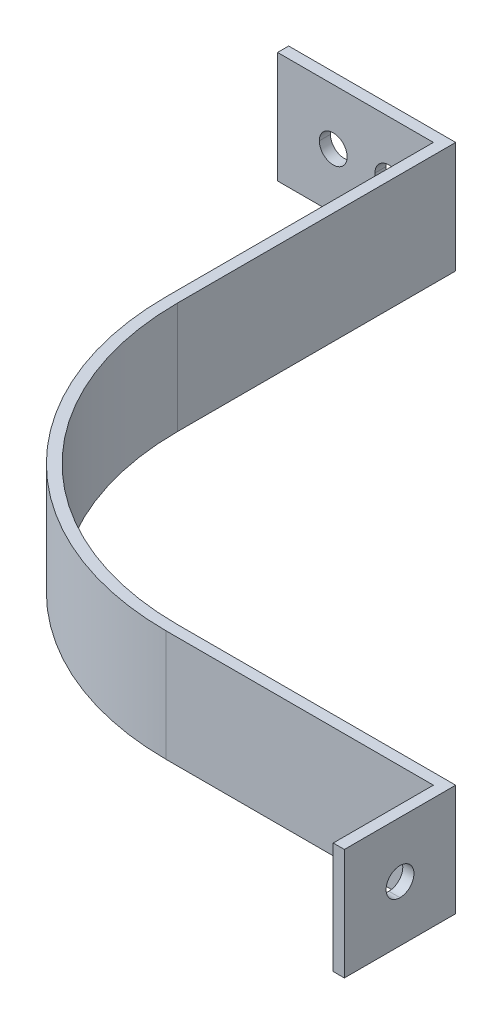
ISO-10303-21;
HEADER;
FILE_DESCRIPTION(('STEP AP214'),'2;1');
FILE_NAME('part.step','',(''),(''),'','','');
FILE_SCHEMA(('AUTOMOTIVE_DESIGN { 1 0 10303 214 1 1 1 1 }'));
ENDSEC;
DATA;
#1=APPLICATION_CONTEXT('core data for automotive mechanical design processes');
#2=APPLICATION_PROTOCOL_DEFINITION('international standard','automotive_design',2000,#1);
#3=PRODUCT_CONTEXT('',#1,'mechanical');
#4=PRODUCT('Part','Part','',(#3));
#5=PRODUCT_RELATED_PRODUCT_CATEGORY('part','',(#4));
#6=PRODUCT_DEFINITION_FORMATION('','',#4);
#7=PRODUCT_DEFINITION_CONTEXT('part definition',#1,'design');
#8=PRODUCT_DEFINITION('design','',#6,#7);
#9=PRODUCT_DEFINITION_SHAPE('','',#8);
#10=(LENGTH_UNIT() NAMED_UNIT(*) SI_UNIT(.MILLI.,.METRE.));
#11=(NAMED_UNIT(*) PLANE_ANGLE_UNIT() SI_UNIT($,.RADIAN.));
#12=(NAMED_UNIT(*) SI_UNIT($,.STERADIAN.) SOLID_ANGLE_UNIT());
#13=UNCERTAINTY_MEASURE_WITH_UNIT(LENGTH_MEASURE(1.E-05),#10,'distance_accuracy_value','');
#14=(GEOMETRIC_REPRESENTATION_CONTEXT(3) GLOBAL_UNCERTAINTY_ASSIGNED_CONTEXT((#13)) GLOBAL_UNIT_ASSIGNED_CONTEXT((#10,
#11,#12)) REPRESENTATION_CONTEXT('',''));
#15=CARTESIAN_POINT('',(0.,0.,0.));
#16=DIRECTION('',(0.,0.,1.));
#17=DIRECTION('',(1.,0.,0.));
#18=AXIS2_PLACEMENT_3D('',#15,#16,#17);
#19=CARTESIAN_POINT('',(27.4712813737907,0.,119.155051635885));
#20=DIRECTION('',(1.,0.,0.));
#21=DIRECTION('',(0.,0.,-1.));
#22=AXIS2_PLACEMENT_3D('',#19,#20,#21);
#23=PLANE('',#22);
#24=DIRECTION('',(0.,0.,-1.));
#25=VECTOR('',#24,1.);
#26=CARTESIAN_POINT('',(27.4712813737907,7.69230769133077,118.385820866752));
#27=LINE('',#26,#25);
#28=CARTESIAN_POINT('',(27.4712813737907,7.69230769133077,119.155051635885));
#29=VERTEX_POINT('',#28);
#30=CARTESIAN_POINT('',(27.4712813737907,7.69230769133077,117.616590097619));
#31=VERTEX_POINT('',#30);
#32=EDGE_CURVE('E11',#29,#31,#27,.T.);
#33=ORIENTED_EDGE('',*,*,#32,.T.);
#34=DIRECTION('',(0.,1.,0.));
#35=VECTOR('',#34,1.);
#36=CARTESIAN_POINT('',(27.4712813737907,0.,117.616590097619));
#37=LINE('',#36,#35);
#38=CARTESIAN_POINT('',(27.4712813737907,-7.69230769133077,117.616590097619));
#39=VERTEX_POINT('',#38);
#40=EDGE_CURVE('E73',#39,#31,#37,.T.);
#41=ORIENTED_EDGE('',*,*,#40,.F.);
#42=DIRECTION('',(0.,0.,-1.));
#43=VECTOR('',#42,1.);
#44=CARTESIAN_POINT('',(27.4712813737907,-7.69230769133077,118.385820866752));
#45=LINE('',#44,#43);
#46=CARTESIAN_POINT('',(27.4712813737907,-7.69230769133077,119.155051635885));
#47=VERTEX_POINT('',#46);
#48=EDGE_CURVE('E52',#47,#39,#45,.T.);
#49=ORIENTED_EDGE('',*,*,#48,.F.);
#50=DIRECTION('',(0.,1.,0.));
#51=VECTOR('',#50,1.);
#52=CARTESIAN_POINT('',(27.4712813737907,0.,119.155051635885));
#53=LINE('',#52,#51);
#54=EDGE_CURVE('E59',#47,#29,#53,.T.);
#55=ORIENTED_EDGE('',*,*,#54,.T.);
#56=EDGE_LOOP('',(#33,#41,#49,#55));
#57=FACE_BOUND('',#56,.T.);
#58=ADVANCED_FACE('F48',(#57),#23,.F.);
#59=CARTESIAN_POINT('',(49.0097429095169,0.,156.078128554273));
#60=DIRECTION('',(1.,0.,0.));
#61=DIRECTION('',(0.,0.,-1.));
#62=AXIS2_PLACEMENT_3D('',#59,#60,#61);
#63=PLANE('',#62);
#64=DIRECTION('',(0.,0.,-1.));
#65=VECTOR('',#64,1.);
#66=CARTESIAN_POINT('',(49.0097429095169,7.69230769133077,137.616590095079));
#67=LINE('',#66,#65);
#68=CARTESIAN_POINT('',(49.0097429095169,7.69230769133077,156.078128554273));
#69=VERTEX_POINT('',#68);
#70=CARTESIAN_POINT('',(49.0097429095169,7.69230769133077,119.155051635885));
#71=VERTEX_POINT('',#70);
#72=EDGE_CURVE('E302',#69,#71,#67,.T.);
#73=ORIENTED_EDGE('',*,*,#72,.T.);
#74=DIRECTION('',(0.,1.,0.));
#75=VECTOR('',#74,1.);
#76=CARTESIAN_POINT('',(49.0097429095169,0.,119.155051635885));
#77=LINE('',#76,#75);
#78=CARTESIAN_POINT('',(49.0097429095169,-7.69230769133077,119.155051635885));
#79=VERTEX_POINT('',#78);
#80=EDGE_CURVE('E282',#79,#71,#77,.T.);
#81=ORIENTED_EDGE('',*,*,#80,.F.);
#82=DIRECTION('',(0.,0.,-1.));
#83=VECTOR('',#82,1.);
#84=CARTESIAN_POINT('',(49.0097429095169,-7.69230769133077,137.616590095079));
#85=LINE('',#84,#83);
#86=CARTESIAN_POINT('',(49.0097429095169,-7.69230769133077,156.078128554273));
#87=VERTEX_POINT('',#86);
#88=EDGE_CURVE('E269',#87,#79,#85,.T.);
#89=ORIENTED_EDGE('',*,*,#88,.F.);
#90=DIRECTION('',(0.,1.,0.));
#91=VECTOR('',#90,1.);
#92=CARTESIAN_POINT('',(49.0097429095169,0.,156.078128554273));
#93=LINE('',#92,#91);
#94=EDGE_CURVE('E306',#87,#69,#93,.T.);
#95=ORIENTED_EDGE('',*,*,#94,.T.);
#96=EDGE_LOOP('',(#73,#81,#89,#95));
#97=FACE_BOUND('',#96,.T.);
#98=ADVANCED_FACE('F882',(#97),#63,.F.);
#99=CARTESIAN_POINT('',(89.0097429044369,0.,156.078128554273));
#100=DIRECTION('',(0.,-1.,0.));
#101=DIRECTION('',(-1.,0.,0.));
#102=AXIS2_PLACEMENT_3D('',#99,#100,#101);
#103=CYLINDRICAL_SURFACE('',#102,39.99999999492);
#104=CARTESIAN_POINT('',(89.0097429044369,7.69230769133077,156.078128554273));
#105=DIRECTION('',(0.,-1.,0.));
#106=DIRECTION('',(-1.,0.,0.));
#107=AXIS2_PLACEMENT_3D('',#104,#105,#106);
#108=CIRCLE('',#107,39.99999999492);
#109=CARTESIAN_POINT('',(89.0097429044369,7.69230769133077,196.078128549193));
#110=VERTEX_POINT('',#109);
#111=EDGE_CURVE('E310',#110,#69,#108,.T.);
#112=ORIENTED_EDGE('',*,*,#111,.T.);
#113=ORIENTED_EDGE('',*,*,#94,.F.);
#114=CARTESIAN_POINT('',(89.0097429044369,-7.69230769133077,156.078128554273));
#115=DIRECTION('',(0.,-1.,0.));
#116=DIRECTION('',(-1.,0.,0.));
#117=AXIS2_PLACEMENT_3D('',#114,#115,#116);
#118=CIRCLE('',#117,39.99999999492);
#119=CARTESIAN_POINT('',(89.0097429044369,-7.69230769133077,196.078128549193));
#120=VERTEX_POINT('',#119);
#121=EDGE_CURVE('E273',#120,#87,#118,.T.);
#122=ORIENTED_EDGE('',*,*,#121,.F.);
#123=DIRECTION('',(0.,1.,0.));
#124=VECTOR('',#123,1.);
#125=CARTESIAN_POINT('',(89.0097429044369,0.,196.078128549193));
#126=LINE('',#125,#124);
#127=EDGE_CURVE('E261',#120,#110,#126,.T.);
#128=ORIENTED_EDGE('',*,*,#127,.T.);
#129=EDGE_LOOP('',(#112,#113,#122,#128));
#130=FACE_BOUND('',#129,.T.);
#131=ADVANCED_FACE('F896',(#130),#103,.T.);
#132=CARTESIAN_POINT('',(125.932819822824,0.,196.078128549193));
#133=DIRECTION('',(0.,0.,-1.));
#134=DIRECTION('',(-1.,0.,0.));
#135=AXIS2_PLACEMENT_3D('',#132,#133,#134);
#136=PLANE('',#135);
#137=DIRECTION('',(-1.,0.,0.));
#138=VECTOR('',#137,1.);
#139=CARTESIAN_POINT('',(107.471281363631,7.69230769133077,196.078128549193));
#140=LINE('',#139,#138);
#141=CARTESIAN_POINT('',(125.932819822824,7.69230769133077,196.078128549193));
#142=VERTEX_POINT('',#141);
#143=EDGE_CURVE('E317',#142,#110,#140,.T.);
#144=ORIENTED_EDGE('',*,*,#143,.T.);
#145=ORIENTED_EDGE('',*,*,#127,.F.);
#146=DIRECTION('',(-1.,0.,0.));
#147=VECTOR('',#146,1.);
#148=CARTESIAN_POINT('',(107.471281363631,-7.69230769133077,196.078128549193));
#149=LINE('',#148,#147);
#150=CARTESIAN_POINT('',(125.932819822824,-7.69230769133077,196.078128549193));
#151=VERTEX_POINT('',#150);
#152=EDGE_CURVE('E324',#151,#120,#149,.T.);
#153=ORIENTED_EDGE('',*,*,#152,.F.);
#154=DIRECTION('',(0.,1.,0.));
#155=VECTOR('',#154,1.);
#156=CARTESIAN_POINT('',(125.932819822824,0.,196.078128549193));
#157=LINE('',#156,#155);
#158=EDGE_CURVE('E314',#151,#142,#157,.T.);
#159=ORIENTED_EDGE('',*,*,#158,.T.);
#160=EDGE_LOOP('',(#144,#145,#153,#159));
#161=FACE_BOUND('',#160,.T.);
#162=ADVANCED_FACE('F773',(#161),#136,.F.);
#163=CARTESIAN_POINT('',(127.471281361091,0.,209.924282393588));
#164=DIRECTION('',(0.,0.,-1.));
#165=DIRECTION('',(-1.,0.,0.));
#166=AXIS2_PLACEMENT_3D('',#163,#164,#165);
#167=PLANE('',#166);
#168=DIRECTION('',(-1.,0.,0.));
#169=VECTOR('',#168,1.);
#170=CARTESIAN_POINT('',(126.702050591958,7.69230769133077,209.924282393588));
#171=LINE('',#170,#169);
#172=CARTESIAN_POINT('',(127.471281361091,7.69230769133077,209.924282393588));
#173=VERTEX_POINT('',#172);
#174=CARTESIAN_POINT('',(125.932819822824,7.69230769133077,209.924282393588));
#175=VERTEX_POINT('',#174);
#176=EDGE_CURVE('E318',#173,#175,#171,.T.);
#177=ORIENTED_EDGE('',*,*,#176,.T.);
#178=DIRECTION('',(0.,1.,0.));
#179=VECTOR('',#178,1.);
#180=CARTESIAN_POINT('',(125.932819822824,0.,209.924282393588));
#181=LINE('',#180,#179);
#182=CARTESIAN_POINT('',(125.932819822824,-7.69230769133077,209.924282393588));
#183=VERTEX_POINT('',#182);
#184=EDGE_CURVE('E301',#183,#175,#181,.T.);
#185=ORIENTED_EDGE('',*,*,#184,.F.);
#186=DIRECTION('',(-1.,0.,0.));
#187=VECTOR('',#186,1.);
#188=CARTESIAN_POINT('',(126.702050591958,-7.69230769133077,209.924282393588));
#189=LINE('',#188,#187);
#190=CARTESIAN_POINT('',(127.471281361091,-7.69230769133077,209.924282393588));
#191=VERTEX_POINT('',#190);
#192=EDGE_CURVE('E252',#191,#183,#189,.T.);
#193=ORIENTED_EDGE('',*,*,#192,.F.);
#194=DIRECTION('',(0.,1.,0.));
#195=VECTOR('',#194,1.);
#196=CARTESIAN_POINT('',(127.471281361091,0.,209.924282393588));
#197=LINE('',#196,#195);
#198=EDGE_CURVE('E250',#191,#173,#197,.T.);
#199=ORIENTED_EDGE('',*,*,#198,.T.);
#200=EDGE_LOOP('',(#177,#185,#193,#199));
#201=FACE_BOUND('',#200,.T.);
#202=ADVANCED_FACE('F784',(#201),#167,.F.);
#203=CARTESIAN_POINT('',(89.0097429044369,0.,194.539667010927));
#204=DIRECTION('',(0.,0.,1.));
#205=DIRECTION('',(1.,0.,0.));
#206=AXIS2_PLACEMENT_3D('',#203,#204,#205);
#207=PLANE('',#206);
#208=DIRECTION('',(1.,0.,0.));
#209=VECTOR('',#208,1.);
#210=CARTESIAN_POINT('',(108.240512132764,7.69230769133077,194.539667010927));
#211=LINE('',#210,#209);
#212=CARTESIAN_POINT('',(89.0097429044369,7.69230769133077,194.539667010927));
#213=VERTEX_POINT('',#212);
#214=CARTESIAN_POINT('',(127.471281361091,7.69230769133077,194.539667010927));
#215=VERTEX_POINT('',#214);
#216=EDGE_CURVE('E224',#213,#215,#211,.T.);
#217=ORIENTED_EDGE('',*,*,#216,.T.);
#218=DIRECTION('',(0.,1.,0.));
#219=VECTOR('',#218,1.);
#220=CARTESIAN_POINT('',(127.471281361091,0.,194.539667010927));
#221=LINE('',#220,#219);
#222=CARTESIAN_POINT('',(127.471281361091,-7.69230769133077,194.539667010927));
#223=VERTEX_POINT('',#222);
#224=EDGE_CURVE('E216',#223,#215,#221,.T.);
#225=ORIENTED_EDGE('',*,*,#224,.F.);
#226=DIRECTION('',(1.,0.,0.));
#227=VECTOR('',#226,1.);
#228=CARTESIAN_POINT('',(108.240512132764,-7.69230769133077,194.539667010927));
#229=LINE('',#228,#227);
#230=CARTESIAN_POINT('',(89.0097429044369,-7.69230769133077,194.539667010927));
#231=VERTEX_POINT('',#230);
#232=EDGE_CURVE('E221',#231,#223,#229,.T.);
#233=ORIENTED_EDGE('',*,*,#232,.F.);
#234=DIRECTION('',(0.,1.,0.));
#235=VECTOR('',#234,1.);
#236=CARTESIAN_POINT('',(89.0097429044369,0.,194.539667010927));
#237=LINE('',#236,#235);
#238=EDGE_CURVE('E397',#231,#213,#237,.T.);
#239=ORIENTED_EDGE('',*,*,#238,.T.);
#240=EDGE_LOOP('',(#217,#225,#233,#239));
#241=FACE_BOUND('',#240,.T.);
#242=ADVANCED_FACE('F219',(#241),#207,.F.);
#243=CARTESIAN_POINT('',(89.0097429044369,0.,156.078128554273));
#244=DIRECTION('',(0.,-1.,0.));
#245=DIRECTION('',(-1.,0.,0.));
#246=AXIS2_PLACEMENT_3D('',#243,#244,#245);
#247=CYLINDRICAL_SURFACE('',#246,38.4615384566538);
#248=CARTESIAN_POINT('',(89.0097429044369,7.69230769133077,156.078128554273));
#249=DIRECTION('',(0.,1.,0.));
#250=DIRECTION('',(-1.,0.,0.));
#251=AXIS2_PLACEMENT_3D('',#248,#249,#250);
#252=CIRCLE('',#251,38.4615384566538);
#253=CARTESIAN_POINT('',(50.548204447783,7.69230769133077,156.078128554273));
#254=VERTEX_POINT('',#253);
#255=EDGE_CURVE('E381',#254,#213,#252,.T.);
#256=ORIENTED_EDGE('',*,*,#255,.T.);
#257=ORIENTED_EDGE('',*,*,#238,.F.);
#258=CARTESIAN_POINT('',(89.0097429044369,-7.69230769133077,156.078128554273));
#259=DIRECTION('',(0.,1.,0.));
#260=DIRECTION('',(-1.,0.,0.));
#261=AXIS2_PLACEMENT_3D('',#258,#259,#260);
#262=CIRCLE('',#261,38.4615384566538);
#263=CARTESIAN_POINT('',(50.548204447783,-7.69230769133077,156.078128554273));
#264=VERTEX_POINT('',#263);
#265=EDGE_CURVE('E243',#264,#231,#262,.T.);
#266=ORIENTED_EDGE('',*,*,#265,.F.);
#267=DIRECTION('',(0.,1.,0.));
#268=VECTOR('',#267,1.);
#269=CARTESIAN_POINT('',(50.548204447783,0.,156.078128554273));
#270=LINE('',#269,#268);
#271=EDGE_CURVE('E369',#264,#254,#270,.T.);
#272=ORIENTED_EDGE('',*,*,#271,.T.);
#273=EDGE_LOOP('',(#256,#257,#266,#272));
#274=FACE_BOUND('',#273,.T.);
#275=ADVANCED_FACE('F851',(#274),#247,.F.);
#276=CARTESIAN_POINT('',(50.548204447783,0.,117.616590097619));
#277=DIRECTION('',(-1.,0.,0.));
#278=DIRECTION('',(0.,0.,1.));
#279=AXIS2_PLACEMENT_3D('',#276,#277,#278);
#280=PLANE('',#279);
#281=DIRECTION('',(0.,0.,1.));
#282=VECTOR('',#281,1.);
#283=CARTESIAN_POINT('',(50.548204447783,7.69230769133077,136.847359325946));
#284=LINE('',#283,#282);
#285=CARTESIAN_POINT('',(50.548204447783,7.69230769133077,117.616590097619));
#286=VERTEX_POINT('',#285);
#287=EDGE_CURVE('E286',#286,#254,#284,.T.);
#288=ORIENTED_EDGE('',*,*,#287,.T.);
#289=ORIENTED_EDGE('',*,*,#271,.F.);
#290=DIRECTION('',(0.,0.,1.));
#291=VECTOR('',#290,1.);
#292=CARTESIAN_POINT('',(50.548204447783,-7.69230769133077,136.847359325946));
#293=LINE('',#292,#291);
#294=CARTESIAN_POINT('',(50.548204447783,-7.69230769133077,117.616590097619));
#295=VERTEX_POINT('',#294);
#296=EDGE_CURVE('E329',#295,#264,#293,.T.);
#297=ORIENTED_EDGE('',*,*,#296,.F.);
#298=DIRECTION('',(0.,1.,0.));
#299=VECTOR('',#298,1.);
#300=CARTESIAN_POINT('',(50.548204447783,0.,117.616590097619));
#301=LINE('',#300,#299);
#302=EDGE_CURVE('E283',#295,#286,#301,.T.);
#303=ORIENTED_EDGE('',*,*,#302,.T.);
#304=EDGE_LOOP('',(#288,#289,#297,#303));
#305=FACE_BOUND('',#304,.T.);
#306=ADVANCED_FACE('F809',(#305),#280,.F.);
#307=CARTESIAN_POINT('',(50.548204447783,-7.69230769133077,117.616590097619));
#308=DIRECTION('',(0.,1.,0.));
#309=DIRECTION('',(-1.,0.,0.));
#310=AXIS2_PLACEMENT_3D('',#307,#308,#309);
#311=PLANE('',#310);
#312=DIRECTION('',(1.,0.,0.));
#313=VECTOR('',#312,1.);
#314=CARTESIAN_POINT('',(39.0097429107869,-7.69230769133077,117.616590097619));
#315=LINE('',#314,#313);
#316=EDGE_CURVE('E287',#39,#295,#315,.T.);
#317=ORIENTED_EDGE('',*,*,#316,.T.);
#318=ORIENTED_EDGE('',*,*,#296,.T.);
#319=ORIENTED_EDGE('',*,*,#265,.T.);
#320=ORIENTED_EDGE('',*,*,#232,.T.);
#321=DIRECTION('',(0.,0.,1.));
#322=VECTOR('',#321,1.);
#323=CARTESIAN_POINT('',(127.471281361091,-7.69230769133077,202.231974702258));
#324=LINE('',#323,#322);
#325=EDGE_CURVE('E240',#223,#191,#324,.T.);
#326=ORIENTED_EDGE('',*,*,#325,.T.);
#327=ORIENTED_EDGE('',*,*,#192,.T.);
#328=DIRECTION('',(0.,0.,-1.));
#329=VECTOR('',#328,1.);
#330=CARTESIAN_POINT('',(125.932819822824,-7.69230769133077,203.001205471391));
#331=LINE('',#330,#329);
#332=EDGE_CURVE('E257',#183,#151,#331,.T.);
#333=ORIENTED_EDGE('',*,*,#332,.T.);
#334=ORIENTED_EDGE('',*,*,#152,.T.);
#335=ORIENTED_EDGE('',*,*,#121,.T.);
#336=ORIENTED_EDGE('',*,*,#88,.T.);
#337=DIRECTION('',(-1.,0.,0.));
#338=VECTOR('',#337,1.);
#339=CARTESIAN_POINT('',(38.2405121416538,-7.69230769133077,119.155051635885));
#340=LINE('',#339,#338);
#341=EDGE_CURVE('E274',#79,#47,#340,.T.);
#342=ORIENTED_EDGE('',*,*,#341,.T.);
#343=ORIENTED_EDGE('',*,*,#48,.T.);
#344=EDGE_LOOP('',(#317,#318,#319,#320,#326,#327,#333,#334,#335,#336,#342,#343));
#345=FACE_BOUND('',#344,.T.);
#346=ADVANCED_FACE('F238',(#345),#311,.F.);
#347=CARTESIAN_POINT('',(50.548204447783,7.69230769133077,117.616590097619));
#348=DIRECTION('',(0.,1.,0.));
#349=DIRECTION('',(-1.,0.,0.));
#350=AXIS2_PLACEMENT_3D('',#347,#348,#349);
#351=PLANE('',#350);
#352=ORIENTED_EDGE('',*,*,#32,.F.);
#353=DIRECTION('',(-1.,0.,0.));
#354=VECTOR('',#353,1.);
#355=CARTESIAN_POINT('',(38.2405121416538,7.69230769133077,119.155051635885));
#356=LINE('',#355,#354);
#357=EDGE_CURVE('E321',#71,#29,#356,.T.);
#358=ORIENTED_EDGE('',*,*,#357,.F.);
#359=ORIENTED_EDGE('',*,*,#72,.F.);
#360=ORIENTED_EDGE('',*,*,#111,.F.);
#361=ORIENTED_EDGE('',*,*,#143,.F.);
#362=DIRECTION('',(0.,0.,-1.));
#363=VECTOR('',#362,1.);
#364=CARTESIAN_POINT('',(125.932819822824,7.69230769133077,203.001205471391));
#365=LINE('',#364,#363);
#366=EDGE_CURVE('E297',#175,#142,#365,.T.);
#367=ORIENTED_EDGE('',*,*,#366,.F.);
#368=ORIENTED_EDGE('',*,*,#176,.F.);
#369=DIRECTION('',(0.,0.,1.));
#370=VECTOR('',#369,1.);
#371=CARTESIAN_POINT('',(127.471281361091,7.69230769133077,202.231974702258));
#372=LINE('',#371,#370);
#373=EDGE_CURVE('E230',#215,#173,#372,.T.);
#374=ORIENTED_EDGE('',*,*,#373,.F.);
#375=ORIENTED_EDGE('',*,*,#216,.F.);
#376=ORIENTED_EDGE('',*,*,#255,.F.);
#377=ORIENTED_EDGE('',*,*,#287,.F.);
#378=DIRECTION('',(1.,0.,0.));
#379=VECTOR('',#378,1.);
#380=CARTESIAN_POINT('',(39.0097429107869,7.69230769133077,117.616590097619));
#381=LINE('',#380,#379);
#382=EDGE_CURVE('E363',#31,#286,#381,.T.);
#383=ORIENTED_EDGE('',*,*,#382,.F.);
#384=EDGE_LOOP('',(#352,#358,#359,#360,#361,#367,#368,#374,#375,#376,#377,#383));
#385=FACE_BOUND('',#384,.T.);
#386=ADVANCED_FACE('F876',(#385),#351,.T.);
#387=CARTESIAN_POINT('',(27.4712813737907,0.,117.616590097619));
#388=DIRECTION('',(0.,0.,1.));
#389=DIRECTION('',(1.,0.,0.));
#390=AXIS2_PLACEMENT_3D('',#387,#388,#389);
#391=PLANE('',#390);
#392=ORIENTED_EDGE('',*,*,#382,.T.);
#393=ORIENTED_EDGE('',*,*,#302,.F.);
#394=ORIENTED_EDGE('',*,*,#316,.F.);
#395=ORIENTED_EDGE('',*,*,#40,.T.);
#396=EDGE_LOOP('',(#392,#393,#394,#395));
#397=FACE_BOUND('',#396,.T.);
#398=CARTESIAN_POINT('',(35.1635890651215,0.,117.616590097619));
#399=DIRECTION('',(0.,0.,1.));
#400=DIRECTION('',(1.,0.,0.));
#401=AXIS2_PLACEMENT_3D('',#398,#399,#400);
#402=CIRCLE('',#401,1.92307692283269);
#403=CARTESIAN_POINT('',(33.2405121422888,0.,117.616590097619));
#404=VERTEX_POINT('',#403);
#405=CARTESIAN_POINT('',(37.0866659879542,0.,117.616590097619));
#406=VERTEX_POINT('',#405);
#407=EDGE_CURVE('E384',#404,#406,#402,.T.);
#408=ORIENTED_EDGE('',*,*,#407,.T.);
#409=CARTESIAN_POINT('',(35.1635890651215,0.,117.616590097619));
#410=DIRECTION('',(0.,0.,1.));
#411=DIRECTION('',(1.,0.,0.));
#412=AXIS2_PLACEMENT_3D('',#409,#410,#411);
#413=CIRCLE('',#412,1.9230769228327);
#414=EDGE_CURVE('E292',#406,#404,#413,.T.);
#415=ORIENTED_EDGE('',*,*,#414,.T.);
#416=EDGE_LOOP('',(#408,#415));
#417=FACE_BOUND('',#416,.T.);
#418=CARTESIAN_POINT('',(42.8558967564523,0.,117.616590097619));
#419=DIRECTION('',(0.,0.,1.));
#420=DIRECTION('',(1.,0.,0.));
#421=AXIS2_PLACEMENT_3D('',#418,#419,#420);
#422=CIRCLE('',#421,1.92307692283269);
#423=CARTESIAN_POINT('',(40.9328198336196,0.,117.616590097619));
#424=VERTEX_POINT('',#423);
#425=CARTESIAN_POINT('',(44.7789736792849,0.,117.616590097619));
#426=VERTEX_POINT('',#425);
#427=EDGE_CURVE('E288',#424,#426,#422,.T.);
#428=ORIENTED_EDGE('',*,*,#427,.T.);
#429=CARTESIAN_POINT('',(42.8558967564523,0.,117.616590097619));
#430=DIRECTION('',(0.,0.,1.));
#431=DIRECTION('',(1.,0.,0.));
#432=AXIS2_PLACEMENT_3D('',#429,#430,#431);
#433=CIRCLE('',#432,1.92307692283269);
#434=EDGE_CURVE('E293',#426,#424,#433,.T.);
#435=ORIENTED_EDGE('',*,*,#434,.T.);
#436=EDGE_LOOP('',(#428,#435));
#437=FACE_BOUND('',#436,.T.);
#438=ADVANCED_FACE('F817',(#397,#417,#437),#391,.F.);
#439=CARTESIAN_POINT('',(49.0097429095169,0.,119.155051635885));
#440=DIRECTION('',(0.,0.,-1.));
#441=DIRECTION('',(-1.,0.,0.));
#442=AXIS2_PLACEMENT_3D('',#439,#440,#441);
#443=PLANE('',#442);
#444=ORIENTED_EDGE('',*,*,#357,.T.);
#445=ORIENTED_EDGE('',*,*,#54,.F.);
#446=ORIENTED_EDGE('',*,*,#341,.F.);
#447=ORIENTED_EDGE('',*,*,#80,.T.);
#448=EDGE_LOOP('',(#444,#445,#446,#447));
#449=FACE_BOUND('',#448,.T.);
#450=CARTESIAN_POINT('',(35.1635890651215,0.,119.155051635885));
#451=DIRECTION('',(0.,0.,1.));
#452=DIRECTION('',(1.,0.,0.));
#453=AXIS2_PLACEMENT_3D('',#450,#451,#452);
#454=CIRCLE('',#453,1.92307692283269);
#455=CARTESIAN_POINT('',(33.2405121422888,0.,119.155051635885));
#456=VERTEX_POINT('',#455);
#457=CARTESIAN_POINT('',(37.0866659879542,0.,119.155051635885));
#458=VERTEX_POINT('',#457);
#459=EDGE_CURVE('E333',#456,#458,#454,.T.);
#460=ORIENTED_EDGE('',*,*,#459,.F.);
#461=CARTESIAN_POINT('',(35.1635890651215,0.,119.155051635885));
#462=DIRECTION('',(0.,0.,1.));
#463=DIRECTION('',(1.,0.,0.));
#464=AXIS2_PLACEMENT_3D('',#461,#462,#463);
#465=CIRCLE('',#464,1.92307692283269);
#466=EDGE_CURVE('E350',#458,#456,#465,.T.);
#467=ORIENTED_EDGE('',*,*,#466,.F.);
#468=EDGE_LOOP('',(#460,#467));
#469=FACE_BOUND('',#468,.T.);
#470=CARTESIAN_POINT('',(42.8558967564523,0.,119.155051635885));
#471=DIRECTION('',(0.,0.,1.));
#472=DIRECTION('',(1.,0.,0.));
#473=AXIS2_PLACEMENT_3D('',#470,#471,#472);
#474=CIRCLE('',#473,1.92307692283269);
#475=CARTESIAN_POINT('',(40.9328198336196,0.,119.155051635885));
#476=VERTEX_POINT('',#475);
#477=CARTESIAN_POINT('',(44.7789736792849,0.,119.155051635885));
#478=VERTEX_POINT('',#477);
#479=EDGE_CURVE('E278',#476,#478,#474,.T.);
#480=ORIENTED_EDGE('',*,*,#479,.F.);
#481=CARTESIAN_POINT('',(42.8558967564523,0.,119.155051635885));
#482=DIRECTION('',(0.,0.,1.));
#483=DIRECTION('',(1.,0.,0.));
#484=AXIS2_PLACEMENT_3D('',#481,#482,#483);
#485=CIRCLE('',#484,1.92307692283269);
#486=EDGE_CURVE('E263',#478,#476,#485,.T.);
#487=ORIENTED_EDGE('',*,*,#486,.F.);
#488=EDGE_LOOP('',(#480,#487));
#489=FACE_BOUND('',#488,.T.);
#490=ADVANCED_FACE('F796',(#449,#469,#489),#443,.F.);
#491=CARTESIAN_POINT('',(42.8558967564523,0.,115.30889779022));
#492=DIRECTION('',(0.,0.,-1.));
#493=DIRECTION('',(1.,0.,0.));
#494=AXIS2_PLACEMENT_3D('',#491,#492,#493);
#495=CYLINDRICAL_SURFACE('',#494,1.92307692283269);
#496=ORIENTED_EDGE('',*,*,#427,.F.);
#497=DIRECTION('',(0.,0.,-1.));
#498=VECTOR('',#497,1.);
#499=CARTESIAN_POINT('',(40.9328198336196,0.,115.30889779022));
#500=LINE('',#499,#498);
#501=EDGE_CURVE('E267',#476,#424,#500,.T.);
#502=ORIENTED_EDGE('',*,*,#501,.F.);
#503=ORIENTED_EDGE('',*,*,#479,.T.);
#504=DIRECTION('',(0.,0.,-1.));
#505=VECTOR('',#504,1.);
#506=CARTESIAN_POINT('',(44.7789736792849,0.,115.30889779022));
#507=LINE('',#506,#505);
#508=EDGE_CURVE('E266',#478,#426,#507,.T.);
#509=ORIENTED_EDGE('',*,*,#508,.T.);
#510=EDGE_LOOP('',(#496,#502,#503,#509));
#511=FACE_BOUND('',#510,.T.);
#512=ADVANCED_FACE('F869',(#511),#495,.F.);
#513=CARTESIAN_POINT('',(42.8558967564523,0.,115.30889779022));
#514=DIRECTION('',(0.,0.,-1.));
#515=DIRECTION('',(1.,0.,0.));
#516=AXIS2_PLACEMENT_3D('',#513,#514,#515);
#517=CYLINDRICAL_SURFACE('',#516,1.92307692283269);
#518=ORIENTED_EDGE('',*,*,#434,.F.);
#519=ORIENTED_EDGE('',*,*,#508,.F.);
#520=ORIENTED_EDGE('',*,*,#486,.T.);
#521=ORIENTED_EDGE('',*,*,#501,.T.);
#522=EDGE_LOOP('',(#518,#519,#520,#521));
#523=FACE_BOUND('',#522,.T.);
#524=ADVANCED_FACE('F823',(#523),#517,.F.);
#525=CARTESIAN_POINT('',(35.1635890651215,0.,115.30889779022));
#526=DIRECTION('',(0.,0.,-1.));
#527=DIRECTION('',(1.,0.,0.));
#528=AXIS2_PLACEMENT_3D('',#525,#526,#527);
#529=CYLINDRICAL_SURFACE('',#528,1.92307692283269);
#530=ORIENTED_EDGE('',*,*,#407,.F.);
#531=DIRECTION('',(0.,0.,-1.));
#532=VECTOR('',#531,1.);
#533=CARTESIAN_POINT('',(33.2405121422888,0.,115.30889779022));
#534=LINE('',#533,#532);
#535=EDGE_CURVE('E357',#456,#404,#534,.T.);
#536=ORIENTED_EDGE('',*,*,#535,.F.);
#537=ORIENTED_EDGE('',*,*,#459,.T.);
#538=DIRECTION('',(0.,0.,-1.));
#539=VECTOR('',#538,1.);
#540=CARTESIAN_POINT('',(37.0866659879542,0.,115.30889779022));
#541=LINE('',#540,#539);
#542=EDGE_CURVE('E340',#458,#406,#541,.T.);
#543=ORIENTED_EDGE('',*,*,#542,.T.);
#544=EDGE_LOOP('',(#530,#536,#537,#543));
#545=FACE_BOUND('',#544,.T.);
#546=ADVANCED_FACE('F829',(#545),#529,.F.);
#547=CARTESIAN_POINT('',(35.1635890651215,0.,115.30889779022));
#548=DIRECTION('',(0.,0.,-1.));
#549=DIRECTION('',(1.,0.,0.));
#550=AXIS2_PLACEMENT_3D('',#547,#548,#549);
#551=CYLINDRICAL_SURFACE('',#550,1.92307692283269);
#552=ORIENTED_EDGE('',*,*,#414,.F.);
#553=ORIENTED_EDGE('',*,*,#542,.F.);
#554=ORIENTED_EDGE('',*,*,#466,.T.);
#555=ORIENTED_EDGE('',*,*,#535,.T.);
#556=EDGE_LOOP('',(#552,#553,#554,#555));
#557=FACE_BOUND('',#556,.T.);
#558=ADVANCED_FACE('F790',(#557),#551,.F.);
#559=CARTESIAN_POINT('',(127.471281361091,0.,194.539667010927));
#560=DIRECTION('',(-1.,0.,0.));
#561=DIRECTION('',(0.,0.,1.));
#562=AXIS2_PLACEMENT_3D('',#559,#560,#561);
#563=PLANE('',#562);
#564=ORIENTED_EDGE('',*,*,#373,.T.);
#565=ORIENTED_EDGE('',*,*,#198,.F.);
#566=ORIENTED_EDGE('',*,*,#325,.F.);
#567=ORIENTED_EDGE('',*,*,#224,.T.);
#568=EDGE_LOOP('',(#564,#565,#566,#567));
#569=FACE_BOUND('',#568,.T.);
#570=CARTESIAN_POINT('',(127.471281361091,0.,202.231974702258));
#571=DIRECTION('',(-1.,0.,0.));
#572=DIRECTION('',(0.,0.,1.));
#573=AXIS2_PLACEMENT_3D('',#570,#571,#572);
#574=CIRCLE('',#573,1.92307692283269);
#575=CARTESIAN_POINT('',(127.471281361091,1.92307692283269,202.231974702258));
#576=VERTEX_POINT('',#575);
#577=CARTESIAN_POINT('',(127.471281361091,-1.92307692283269,202.231974702258));
#578=VERTEX_POINT('',#577);
#579=EDGE_CURVE('E231',#576,#578,#574,.T.);
#580=ORIENTED_EDGE('',*,*,#579,.T.);
#581=CARTESIAN_POINT('',(127.471281361091,0.,202.231974702258));
#582=DIRECTION('',(-1.,0.,0.));
#583=DIRECTION('',(0.,0.,1.));
#584=AXIS2_PLACEMENT_3D('',#581,#582,#583);
#585=CIRCLE('',#584,1.92307692283269);
#586=EDGE_CURVE('E294',#578,#576,#585,.T.);
#587=ORIENTED_EDGE('',*,*,#586,.T.);
#588=EDGE_LOOP('',(#580,#587));
#589=FACE_BOUND('',#588,.T.);
#590=ADVANCED_FACE('F248',(#569,#589),#563,.F.);
#591=CARTESIAN_POINT('',(125.932819822824,0.,209.924282393589));
#592=DIRECTION('',(1.,0.,0.));
#593=DIRECTION('',(0.,0.,-1.));
#594=AXIS2_PLACEMENT_3D('',#591,#592,#593);
#595=PLANE('',#594);
#596=ORIENTED_EDGE('',*,*,#366,.T.);
#597=ORIENTED_EDGE('',*,*,#158,.F.);
#598=ORIENTED_EDGE('',*,*,#332,.F.);
#599=ORIENTED_EDGE('',*,*,#184,.T.);
#600=EDGE_LOOP('',(#596,#597,#598,#599));
#601=FACE_BOUND('',#600,.T.);
#602=CARTESIAN_POINT('',(125.932819822824,0.,202.231974702258));
#603=DIRECTION('',(-1.,0.,0.));
#604=DIRECTION('',(0.,-1.,0.));
#605=AXIS2_PLACEMENT_3D('',#602,#603,#604);
#606=CIRCLE('',#605,1.92307692283269);
#607=CARTESIAN_POINT('',(125.932819822824,1.92307692283269,202.231974702258));
#608=VERTEX_POINT('',#607);
#609=CARTESIAN_POINT('',(125.932819822824,-1.92307692283269,202.231974702258));
#610=VERTEX_POINT('',#609);
#611=EDGE_CURVE('E375',#608,#610,#606,.T.);
#612=ORIENTED_EDGE('',*,*,#611,.F.);
#613=CARTESIAN_POINT('',(125.932819822824,0.,202.231974702258));
#614=DIRECTION('',(-1.,0.,0.));
#615=DIRECTION('',(0.,-1.,0.));
#616=AXIS2_PLACEMENT_3D('',#613,#614,#615);
#617=CIRCLE('',#616,1.92307692283269);
#618=EDGE_CURVE('E149',#610,#608,#617,.T.);
#619=ORIENTED_EDGE('',*,*,#618,.F.);
#620=EDGE_LOOP('',(#612,#619));
#621=FACE_BOUND('',#620,.T.);
#622=ADVANCED_FACE('F834',(#601,#621),#595,.F.);
#623=CARTESIAN_POINT('',(129.77897366849,0.,202.231974702258));
#624=DIRECTION('',(1.,0.,0.));
#625=DIRECTION('',(0.,-1.,0.));
#626=AXIS2_PLACEMENT_3D('',#623,#624,#625);
#627=CYLINDRICAL_SURFACE('',#626,1.92307692283269);
#628=ORIENTED_EDGE('',*,*,#579,.F.);
#629=DIRECTION('',(1.,0.,0.));
#630=VECTOR('',#629,1.);
#631=CARTESIAN_POINT('',(129.77897366849,1.92307692283269,202.231974702258));
#632=LINE('',#631,#630);
#633=EDGE_CURVE('E354',#608,#576,#632,.T.);
#634=ORIENTED_EDGE('',*,*,#633,.F.);
#635=ORIENTED_EDGE('',*,*,#611,.T.);
#636=DIRECTION('',(1.,0.,0.));
#637=VECTOR('',#636,1.);
#638=CARTESIAN_POINT('',(129.77897366849,-1.92307692283269,202.231974702258));
#639=LINE('',#638,#637);
#640=EDGE_CURVE('E378',#610,#578,#639,.T.);
#641=ORIENTED_EDGE('',*,*,#640,.T.);
#642=EDGE_LOOP('',(#628,#634,#635,#641));
#643=FACE_BOUND('',#642,.T.);
#644=ADVANCED_FACE('F50',(#643),#627,.F.);
#645=CARTESIAN_POINT('',(129.77897366849,0.,202.231974702258));
#646=DIRECTION('',(1.,0.,0.));
#647=DIRECTION('',(0.,-1.,0.));
#648=AXIS2_PLACEMENT_3D('',#645,#646,#647);
#649=CYLINDRICAL_SURFACE('',#648,1.92307692283269);
#650=ORIENTED_EDGE('',*,*,#586,.F.);
#651=ORIENTED_EDGE('',*,*,#640,.F.);
#652=ORIENTED_EDGE('',*,*,#618,.T.);
#653=ORIENTED_EDGE('',*,*,#633,.T.);
#654=EDGE_LOOP('',(#650,#651,#652,#653));
#655=FACE_BOUND('',#654,.T.);
#656=ADVANCED_FACE('F778',(#655),#649,.F.);
#657=CLOSED_SHELL('',(#58,#98,#131,#162,#202,#242,#275,#306,#346,#386,#438,#490,#512,#524,#546,
#558,#590,#622,#644,#656));
#658=MANIFOLD_SOLID_BREP('B2',#657);
#659=ADVANCED_BREP_SHAPE_REPRESENTATION('',(#18,#658),#14);
#660=SHAPE_DEFINITION_REPRESENTATION(#9,#659);
ENDSEC;
END-ISO-10303-21;
